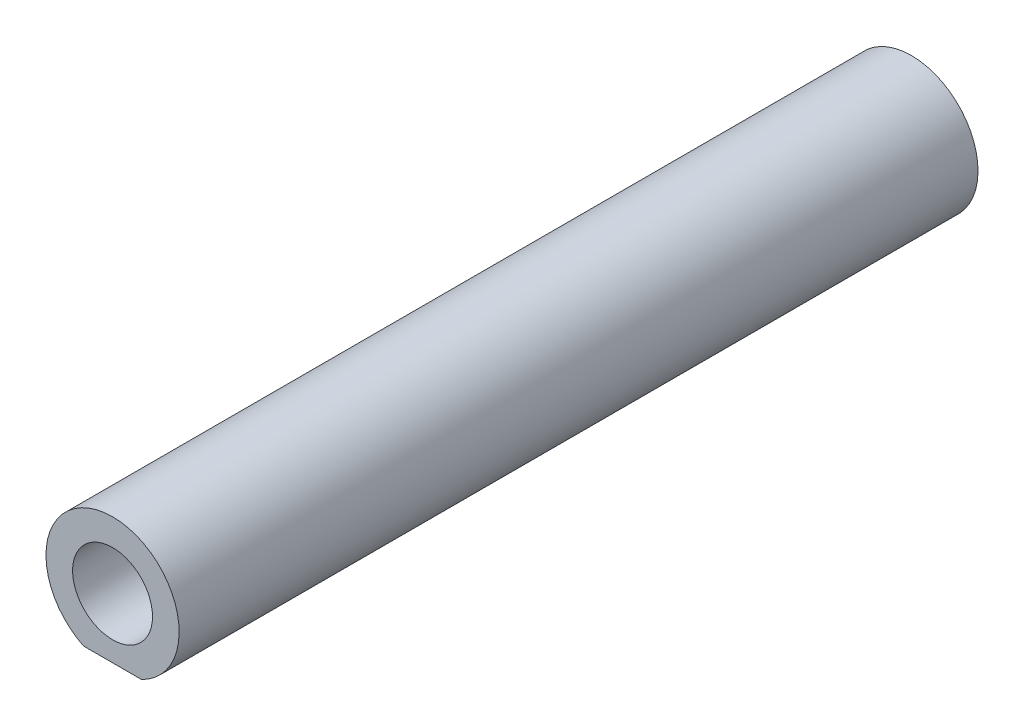
ISO-10303-21;
HEADER;
FILE_DESCRIPTION(('STEP AP214'),'2;1');
FILE_NAME('part.step','',(''),(''),'','','');
FILE_SCHEMA(('AUTOMOTIVE_DESIGN { 1 0 10303 214 1 1 1 1 }'));
ENDSEC;
DATA;
#1=APPLICATION_CONTEXT('core data for automotive mechanical design processes');
#2=APPLICATION_PROTOCOL_DEFINITION('international standard','automotive_design',2000,#1);
#3=PRODUCT_CONTEXT('',#1,'mechanical');
#4=PRODUCT('Part','Part','',(#3));
#5=PRODUCT_RELATED_PRODUCT_CATEGORY('part','',(#4));
#6=PRODUCT_DEFINITION_FORMATION('','',#4);
#7=PRODUCT_DEFINITION_CONTEXT('part definition',#1,'design');
#8=PRODUCT_DEFINITION('design','',#6,#7);
#9=PRODUCT_DEFINITION_SHAPE('','',#8);
#10=(LENGTH_UNIT() NAMED_UNIT(*) SI_UNIT(.MILLI.,.METRE.));
#11=(NAMED_UNIT(*) PLANE_ANGLE_UNIT() SI_UNIT($,.RADIAN.));
#12=(NAMED_UNIT(*) SI_UNIT($,.STERADIAN.) SOLID_ANGLE_UNIT());
#13=UNCERTAINTY_MEASURE_WITH_UNIT(LENGTH_MEASURE(1.E-05),#10,'distance_accuracy_value','');
#14=(GEOMETRIC_REPRESENTATION_CONTEXT(3) GLOBAL_UNCERTAINTY_ASSIGNED_CONTEXT((#13)) GLOBAL_UNIT_ASSIGNED_CONTEXT((#10,
#11,#12)) REPRESENTATION_CONTEXT('',''));
#15=CARTESIAN_POINT('',(0.,0.,0.));
#16=DIRECTION('',(0.,0.,1.));
#17=DIRECTION('',(1.,0.,0.));
#18=AXIS2_PLACEMENT_3D('',#15,#16,#17);
#19=CARTESIAN_POINT('',(0.,0.,-30.));
#20=DIRECTION('',(0.,0.,1.));
#21=DIRECTION('',(1.,0.,0.));
#22=AXIS2_PLACEMENT_3D('',#19,#20,#21);
#23=PLANE('',#22);
#24=CARTESIAN_POINT('',(0.,0.,-30.));
#25=DIRECTION('',(0.,0.,1.));
#26=DIRECTION('',(1.,0.,0.));
#27=AXIS2_PLACEMENT_3D('',#24,#25,#26);
#28=CIRCLE('',#27,3.);
#29=CARTESIAN_POINT('',(3.,0.,-30.));
#30=VERTEX_POINT('',#29);
#31=EDGE_CURVE('E115',#30,#30,#28,.T.);
#32=ORIENTED_EDGE('',*,*,#31,.T.);
#33=EDGE_LOOP('',(#32));
#34=FACE_BOUND('',#33,.T.);
#35=DIRECTION('',(-1.,0.,0.));
#36=VECTOR('',#35,1.);
#37=CARTESIAN_POINT('',(2.17944947177033,-4.5,-30.));
#38=LINE('',#37,#36);
#39=CARTESIAN_POINT('',(2.17944947177033,-4.5,-30.));
#40=VERTEX_POINT('',#39);
#41=CARTESIAN_POINT('',(-2.17944947177034,-4.5,-30.));
#42=VERTEX_POINT('',#41);
#43=EDGE_CURVE('E92',#40,#42,#38,.T.);
#44=ORIENTED_EDGE('',*,*,#43,.T.);
#45=CARTESIAN_POINT('',(0.,0.,-30.));
#46=DIRECTION('',(0.,0.,1.));
#47=DIRECTION('',(1.,0.,0.));
#48=AXIS2_PLACEMENT_3D('',#45,#46,#47);
#49=CIRCLE('',#48,5.);
#50=EDGE_CURVE('E43',#40,#42,#49,.T.);
#51=ORIENTED_EDGE('',*,*,#50,.F.);
#52=EDGE_LOOP('',(#44,#51));
#53=FACE_BOUND('',#52,.T.);
#54=ADVANCED_FACE('F39',(#34,#53),#23,.F.);
#55=CARTESIAN_POINT('',(0.,0.,30.));
#56=DIRECTION('',(0.,0.,-1.));
#57=DIRECTION('',(-1.,0.,0.));
#58=AXIS2_PLACEMENT_3D('',#55,#56,#57);
#59=CYLINDRICAL_SURFACE('',#58,5.);
#60=CARTESIAN_POINT('',(0.,0.,30.));
#61=DIRECTION('',(0.,0.,1.));
#62=DIRECTION('',(1.,0.,0.));
#63=AXIS2_PLACEMENT_3D('',#60,#61,#62);
#64=CIRCLE('',#63,5.);
#65=CARTESIAN_POINT('',(2.17944947177033,-4.5,30.));
#66=VERTEX_POINT('',#65);
#67=CARTESIAN_POINT('',(-2.17944947177034,-4.5,30.));
#68=VERTEX_POINT('',#67);
#69=EDGE_CURVE('E11',#66,#68,#64,.T.);
#70=ORIENTED_EDGE('',*,*,#69,.F.);
#71=DIRECTION('',(0.,0.,1.));
#72=VECTOR('',#71,1.);
#73=CARTESIAN_POINT('',(2.17944947177033,-4.5,20.));
#74=LINE('',#73,#72);
#75=CARTESIAN_POINT('',(2.17944947177033,-4.5,20.));
#76=VERTEX_POINT('',#75);
#77=EDGE_CURVE('E108',#76,#66,#74,.T.);
#78=ORIENTED_EDGE('',*,*,#77,.F.);
#79=CARTESIAN_POINT('',(0.,0.,20.));
#80=DIRECTION('',(0.,0.,1.));
#81=DIRECTION('',(1.,0.,0.));
#82=AXIS2_PLACEMENT_3D('',#79,#80,#81);
#83=CIRCLE('',#82,5.);
#84=CARTESIAN_POINT('',(-2.17944947177034,-4.5,20.));
#85=VERTEX_POINT('',#84);
#86=EDGE_CURVE('E103',#85,#76,#83,.T.);
#87=ORIENTED_EDGE('',*,*,#86,.F.);
#88=DIRECTION('',(0.,0.,1.));
#89=VECTOR('',#88,1.);
#90=CARTESIAN_POINT('',(-2.17944947177034,-4.5,20.));
#91=LINE('',#90,#89);
#92=EDGE_CURVE('E111',#85,#68,#91,.T.);
#93=ORIENTED_EDGE('',*,*,#92,.T.);
#94=EDGE_LOOP('',(#70,#78,#87,#93));
#95=FACE_BOUND('',#94,.T.);
#96=DIRECTION('',(0.,0.,-1.));
#97=VECTOR('',#96,1.);
#98=CARTESIAN_POINT('',(-2.17944947177034,-4.5,-20.));
#99=LINE('',#98,#97);
#100=CARTESIAN_POINT('',(-2.17944947177034,-4.5,-20.));
#101=VERTEX_POINT('',#100);
#102=EDGE_CURVE('E82',#101,#42,#99,.T.);
#103=ORIENTED_EDGE('',*,*,#102,.F.);
#104=CARTESIAN_POINT('',(0.,0.,-20.));
#105=DIRECTION('',(0.,0.,1.));
#106=DIRECTION('',(1.,0.,0.));
#107=AXIS2_PLACEMENT_3D('',#104,#105,#106);
#108=CIRCLE('',#107,5.);
#109=CARTESIAN_POINT('',(2.17944947177033,-4.5,-20.));
#110=VERTEX_POINT('',#109);
#111=EDGE_CURVE('E87',#101,#110,#108,.T.);
#112=ORIENTED_EDGE('',*,*,#111,.T.);
#113=DIRECTION('',(0.,0.,-1.));
#114=VECTOR('',#113,1.);
#115=CARTESIAN_POINT('',(2.17944947177033,-4.5,-20.));
#116=LINE('',#115,#114);
#117=EDGE_CURVE('E55',#110,#40,#116,.T.);
#118=ORIENTED_EDGE('',*,*,#117,.T.);
#119=ORIENTED_EDGE('',*,*,#50,.T.);
#120=EDGE_LOOP('',(#103,#112,#118,#119));
#121=FACE_BOUND('',#120,.T.);
#122=ADVANCED_FACE('F41',(#95,#121),#59,.T.);
#123=CARTESIAN_POINT('',(0.,0.,30.));
#124=DIRECTION('',(0.,0.,1.));
#125=DIRECTION('',(1.,0.,0.));
#126=AXIS2_PLACEMENT_3D('',#123,#124,#125);
#127=PLANE('',#126);
#128=DIRECTION('',(-1.,0.,0.));
#129=VECTOR('',#128,1.);
#130=CARTESIAN_POINT('',(2.17944947177033,-4.5,30.));
#131=LINE('',#130,#129);
#132=EDGE_CURVE('E99',#66,#68,#131,.T.);
#133=ORIENTED_EDGE('',*,*,#132,.F.);
#134=ORIENTED_EDGE('',*,*,#69,.T.);
#135=EDGE_LOOP('',(#133,#134));
#136=FACE_BOUND('',#135,.T.);
#137=CARTESIAN_POINT('',(0.,0.,30.));
#138=DIRECTION('',(0.,0.,1.));
#139=DIRECTION('',(1.,0.,0.));
#140=AXIS2_PLACEMENT_3D('',#137,#138,#139);
#141=CIRCLE('',#140,3.);
#142=CARTESIAN_POINT('',(3.,0.,30.));
#143=VERTEX_POINT('',#142);
#144=EDGE_CURVE('E118',#143,#143,#141,.T.);
#145=ORIENTED_EDGE('',*,*,#144,.F.);
#146=EDGE_LOOP('',(#145));
#147=FACE_BOUND('',#146,.T.);
#148=ADVANCED_FACE('F131',(#136,#147),#127,.T.);
#149=CARTESIAN_POINT('',(0.,0.,30.));
#150=DIRECTION('',(0.,0.,-1.));
#151=DIRECTION('',(-1.,0.,0.));
#152=AXIS2_PLACEMENT_3D('',#149,#150,#151);
#153=CYLINDRICAL_SURFACE('',#152,3.);
#154=ORIENTED_EDGE('',*,*,#144,.T.);
#155=EDGE_LOOP('',(#154));
#156=FACE_BOUND('',#155,.T.);
#157=ORIENTED_EDGE('',*,*,#31,.F.);
#158=EDGE_LOOP('',(#157));
#159=FACE_BOUND('',#158,.T.);
#160=ADVANCED_FACE('F128',(#156,#159),#153,.F.);
#161=CARTESIAN_POINT('',(2.17944947177033,-4.5,20.));
#162=DIRECTION('',(0.,1.,0.));
#163=DIRECTION('',(0.,0.,1.));
#164=AXIS2_PLACEMENT_3D('',#161,#162,#163);
#165=PLANE('',#164);
#166=ORIENTED_EDGE('',*,*,#132,.T.);
#167=ORIENTED_EDGE('',*,*,#92,.F.);
#168=DIRECTION('',(-1.,0.,0.));
#169=VECTOR('',#168,1.);
#170=CARTESIAN_POINT('',(2.17944947177033,-4.5,20.));
#171=LINE('',#170,#169);
#172=EDGE_CURVE('E62',#76,#85,#171,.T.);
#173=ORIENTED_EDGE('',*,*,#172,.F.);
#174=ORIENTED_EDGE('',*,*,#77,.T.);
#175=EDGE_LOOP('',(#166,#167,#173,#174));
#176=FACE_BOUND('',#175,.T.);
#177=ADVANCED_FACE('F130',(#176),#165,.F.);
#178=CARTESIAN_POINT('',(0.,0.,20.));
#179=DIRECTION('',(0.,0.,1.));
#180=DIRECTION('',(1.,0.,0.));
#181=AXIS2_PLACEMENT_3D('',#178,#179,#180);
#182=PLANE('',#181);
#183=ORIENTED_EDGE('',*,*,#86,.T.);
#184=ORIENTED_EDGE('',*,*,#172,.T.);
#185=EDGE_LOOP('',(#183,#184));
#186=FACE_BOUND('',#185,.T.);
#187=ADVANCED_FACE('F138',(#186),#182,.T.);
#188=CARTESIAN_POINT('',(2.17944947177033,-4.5,-20.));
#189=DIRECTION('',(0.,-1.,0.));
#190=DIRECTION('',(0.,0.,-1.));
#191=AXIS2_PLACEMENT_3D('',#188,#189,#190);
#192=PLANE('',#191);
#193=ORIENTED_EDGE('',*,*,#43,.F.);
#194=ORIENTED_EDGE('',*,*,#117,.F.);
#195=DIRECTION('',(-1.,0.,0.));
#196=VECTOR('',#195,1.);
#197=CARTESIAN_POINT('',(2.17944947177033,-4.5,-20.));
#198=LINE('',#197,#196);
#199=EDGE_CURVE('E78',#110,#101,#198,.T.);
#200=ORIENTED_EDGE('',*,*,#199,.T.);
#201=ORIENTED_EDGE('',*,*,#102,.T.);
#202=EDGE_LOOP('',(#193,#194,#200,#201));
#203=FACE_BOUND('',#202,.T.);
#204=ADVANCED_FACE('F80',(#203),#192,.T.);
#205=CARTESIAN_POINT('',(0.,0.,-20.));
#206=DIRECTION('',(0.,0.,-1.));
#207=DIRECTION('',(1.,0.,0.));
#208=AXIS2_PLACEMENT_3D('',#205,#206,#207);
#209=PLANE('',#208);
#210=ORIENTED_EDGE('',*,*,#111,.F.);
#211=ORIENTED_EDGE('',*,*,#199,.F.);
#212=EDGE_LOOP('',(#210,#211));
#213=FACE_BOUND('',#212,.T.);
#214=ADVANCED_FACE('F89',(#213),#209,.T.);
#215=CLOSED_SHELL('',(#54,#122,#148,#160,#177,#187,#204,#214));
#216=MANIFOLD_SOLID_BREP('B2',#215);
#217=ADVANCED_BREP_SHAPE_REPRESENTATION('',(#18,#216),#14);
#218=SHAPE_DEFINITION_REPRESENTATION(#9,#217);
ENDSEC;
END-ISO-10303-21;
